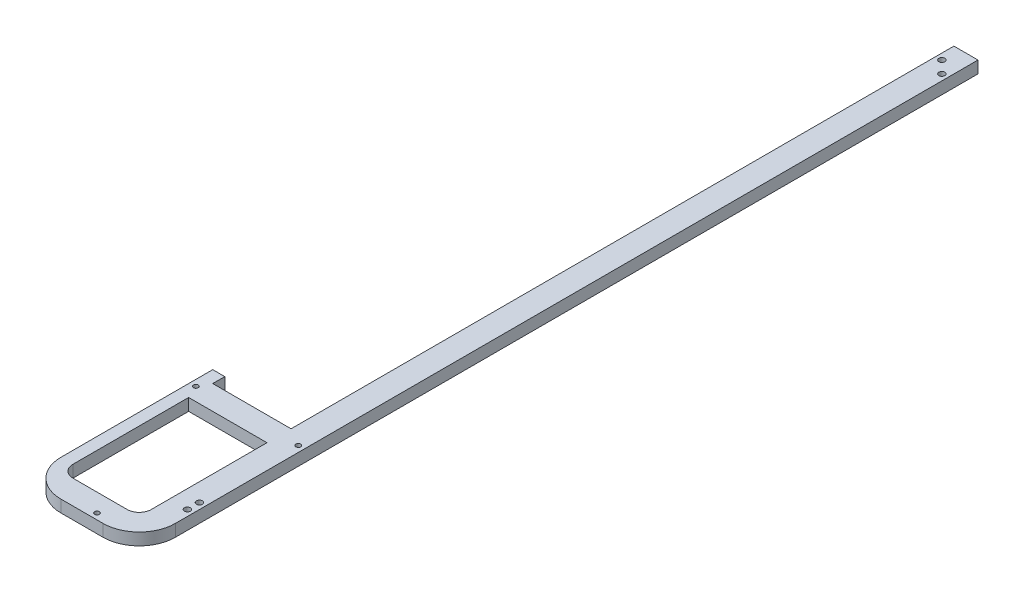
ISO-10303-21;
HEADER;
FILE_DESCRIPTION(('STEP AP214'),'2;1');
FILE_NAME('part.step','',(''),(''),'','','');
FILE_SCHEMA(('AUTOMOTIVE_DESIGN { 1 0 10303 214 1 1 1 1 }'));
ENDSEC;
DATA;
#1=APPLICATION_CONTEXT('core data for automotive mechanical design processes');
#2=APPLICATION_PROTOCOL_DEFINITION('international standard','automotive_design',2000,#1);
#3=PRODUCT_CONTEXT('',#1,'mechanical');
#4=PRODUCT('Part','Part','',(#3));
#5=PRODUCT_RELATED_PRODUCT_CATEGORY('part','',(#4));
#6=PRODUCT_DEFINITION_FORMATION('','',#4);
#7=PRODUCT_DEFINITION_CONTEXT('part definition',#1,'design');
#8=PRODUCT_DEFINITION('design','',#6,#7);
#9=PRODUCT_DEFINITION_SHAPE('','',#8);
#10=(LENGTH_UNIT() NAMED_UNIT(*) SI_UNIT(.MILLI.,.METRE.));
#11=(NAMED_UNIT(*) PLANE_ANGLE_UNIT() SI_UNIT($,.RADIAN.));
#12=(NAMED_UNIT(*) SI_UNIT($,.STERADIAN.) SOLID_ANGLE_UNIT());
#13=UNCERTAINTY_MEASURE_WITH_UNIT(LENGTH_MEASURE(1.E-05),#10,'distance_accuracy_value','');
#14=(GEOMETRIC_REPRESENTATION_CONTEXT(3) GLOBAL_UNCERTAINTY_ASSIGNED_CONTEXT((#13)) GLOBAL_UNIT_ASSIGNED_CONTEXT((#10,
#11,#12)) REPRESENTATION_CONTEXT('',''));
#15=CARTESIAN_POINT('',(0.,0.,0.));
#16=DIRECTION('',(0.,0.,1.));
#17=DIRECTION('',(1.,0.,0.));
#18=AXIS2_PLACEMENT_3D('',#15,#16,#17);
#19=CARTESIAN_POINT('',(47.5,10.,0.));
#20=DIRECTION('',(1.,0.,0.));
#21=DIRECTION('',(0.,0.,-1.));
#22=AXIS2_PLACEMENT_3D('',#19,#20,#21);
#23=PLANE('',#22);
#24=DIRECTION('',(0.,0.,1.));
#25=VECTOR('',#24,1.);
#26=CARTESIAN_POINT('',(47.5,10.,0.));
#27=LINE('',#26,#25);
#28=CARTESIAN_POINT('',(47.5,10.,-626.));
#29=VERTEX_POINT('',#28);
#30=CARTESIAN_POINT('',(47.5,10.,40.));
#31=VERTEX_POINT('',#30);
#32=EDGE_CURVE('E260',#29,#31,#27,.T.);
#33=ORIENTED_EDGE('',*,*,#32,.T.);
#34=DIRECTION('',(0.,-1.,0.));
#35=VECTOR('',#34,1.);
#36=CARTESIAN_POINT('',(47.5,0.,40.));
#37=LINE('',#36,#35);
#38=CARTESIAN_POINT('',(47.5,0.,40.));
#39=VERTEX_POINT('',#38);
#40=EDGE_CURVE('E339',#31,#39,#37,.T.);
#41=ORIENTED_EDGE('',*,*,#40,.T.);
#42=DIRECTION('',(0.,0.,1.));
#43=VECTOR('',#42,1.);
#44=CARTESIAN_POINT('',(47.5,0.,0.));
#45=LINE('',#44,#43);
#46=CARTESIAN_POINT('',(47.5,0.,-626.));
#47=VERTEX_POINT('',#46);
#48=EDGE_CURVE('E240',#47,#39,#45,.T.);
#49=ORIENTED_EDGE('',*,*,#48,.F.);
#50=DIRECTION('',(0.,-1.,0.));
#51=VECTOR('',#50,1.);
#52=CARTESIAN_POINT('',(47.5,10.,-626.));
#53=LINE('',#52,#51);
#54=EDGE_CURVE('E336',#29,#47,#53,.T.);
#55=ORIENTED_EDGE('',*,*,#54,.F.);
#56=EDGE_LOOP('',(#33,#41,#49,#55));
#57=FACE_BOUND('',#56,.T.);
#58=ADVANCED_FACE('F41',(#57),#23,.T.);
#59=CARTESIAN_POINT('',(0.,10.,-626.));
#60=DIRECTION('',(0.,0.,-1.));
#61=DIRECTION('',(-1.,0.,0.));
#62=AXIS2_PLACEMENT_3D('',#59,#60,#61);
#63=PLANE('',#62);
#64=DIRECTION('',(1.,0.,0.));
#65=VECTOR('',#64,1.);
#66=CARTESIAN_POINT('',(0.,0.,-626.));
#67=LINE('',#66,#65);
#68=CARTESIAN_POINT('',(27.5,0.,-626.));
#69=VERTEX_POINT('',#68);
#70=EDGE_CURVE('E295',#69,#47,#67,.T.);
#71=ORIENTED_EDGE('',*,*,#70,.F.);
#72=DIRECTION('',(0.,-1.,0.));
#73=VECTOR('',#72,1.);
#74=CARTESIAN_POINT('',(27.5,10.,-626.));
#75=LINE('',#74,#73);
#76=CARTESIAN_POINT('',(27.5,10.,-626.));
#77=VERTEX_POINT('',#76);
#78=EDGE_CURVE('E333',#77,#69,#75,.T.);
#79=ORIENTED_EDGE('',*,*,#78,.F.);
#80=DIRECTION('',(1.,0.,0.));
#81=VECTOR('',#80,1.);
#82=CARTESIAN_POINT('',(0.,10.,-626.));
#83=LINE('',#82,#81);
#84=EDGE_CURVE('E264',#77,#29,#83,.T.);
#85=ORIENTED_EDGE('',*,*,#84,.T.);
#86=ORIENTED_EDGE('',*,*,#54,.T.);
#87=EDGE_LOOP('',(#71,#79,#85,#86));
#88=FACE_BOUND('',#87,.T.);
#89=ADVANCED_FACE('F400',(#88),#63,.T.);
#90=CARTESIAN_POINT('',(27.5,10.,0.));
#91=DIRECTION('',(-1.,0.,0.));
#92=DIRECTION('',(0.,0.,1.));
#93=AXIS2_PLACEMENT_3D('',#90,#91,#92);
#94=PLANE('',#93);
#95=DIRECTION('',(0.,0.,-1.));
#96=VECTOR('',#95,1.);
#97=CARTESIAN_POINT('',(27.5,0.,0.));
#98=LINE('',#97,#96);
#99=CARTESIAN_POINT('',(27.5,0.,-76.));
#100=VERTEX_POINT('',#99);
#101=EDGE_CURVE('E299',#100,#69,#98,.T.);
#102=ORIENTED_EDGE('',*,*,#101,.F.);
#103=DIRECTION('',(0.,-1.,0.));
#104=VECTOR('',#103,1.);
#105=CARTESIAN_POINT('',(27.5,10.,-76.));
#106=LINE('',#105,#104);
#107=CARTESIAN_POINT('',(27.5,10.,-76.));
#108=VERTEX_POINT('',#107);
#109=EDGE_CURVE('E330',#108,#100,#106,.T.);
#110=ORIENTED_EDGE('',*,*,#109,.F.);
#111=DIRECTION('',(0.,0.,-1.));
#112=VECTOR('',#111,1.);
#113=CARTESIAN_POINT('',(27.5,10.,0.));
#114=LINE('',#113,#112);
#115=EDGE_CURVE('E269',#108,#77,#114,.T.);
#116=ORIENTED_EDGE('',*,*,#115,.T.);
#117=ORIENTED_EDGE('',*,*,#78,.T.);
#118=EDGE_LOOP('',(#102,#110,#116,#117));
#119=FACE_BOUND('',#118,.T.);
#120=ADVANCED_FACE('F406',(#119),#94,.T.);
#121=CARTESIAN_POINT('',(0.,10.,-76.));
#122=DIRECTION('',(0.,0.,-1.));
#123=DIRECTION('',(-1.,0.,0.));
#124=AXIS2_PLACEMENT_3D('',#121,#122,#123);
#125=PLANE('',#124);
#126=DIRECTION('',(1.,0.,0.));
#127=VECTOR('',#126,1.);
#128=CARTESIAN_POINT('',(0.,0.,-76.));
#129=LINE('',#128,#127);
#130=CARTESIAN_POINT('',(-37.5,0.,-76.));
#131=VERTEX_POINT('',#130);
#132=EDGE_CURVE('E303',#131,#100,#129,.T.);
#133=ORIENTED_EDGE('',*,*,#132,.F.);
#134=DIRECTION('',(0.,-1.,0.));
#135=VECTOR('',#134,1.);
#136=CARTESIAN_POINT('',(-37.5,10.,-76.));
#137=LINE('',#136,#135);
#138=CARTESIAN_POINT('',(-37.5,10.,-76.));
#139=VERTEX_POINT('',#138);
#140=EDGE_CURVE('E327',#139,#131,#137,.T.);
#141=ORIENTED_EDGE('',*,*,#140,.F.);
#142=DIRECTION('',(1.,0.,0.));
#143=VECTOR('',#142,1.);
#144=CARTESIAN_POINT('',(0.,10.,-76.));
#145=LINE('',#144,#143);
#146=EDGE_CURVE('E273',#139,#108,#145,.T.);
#147=ORIENTED_EDGE('',*,*,#146,.T.);
#148=ORIENTED_EDGE('',*,*,#109,.T.);
#149=EDGE_LOOP('',(#133,#141,#147,#148));
#150=FACE_BOUND('',#149,.T.);
#151=ADVANCED_FACE('F447',(#150),#125,.T.);
#152=CARTESIAN_POINT('',(-37.5,10.,0.));
#153=DIRECTION('',(-1.,0.,0.));
#154=DIRECTION('',(0.,0.,1.));
#155=AXIS2_PLACEMENT_3D('',#152,#153,#154);
#156=PLANE('',#155);
#157=DIRECTION('',(0.,0.,-1.));
#158=VECTOR('',#157,1.);
#159=CARTESIAN_POINT('',(-37.5,0.,0.));
#160=LINE('',#159,#158);
#161=CARTESIAN_POINT('',(-37.5,0.,-86.));
#162=VERTEX_POINT('',#161);
#163=EDGE_CURVE('E307',#131,#162,#160,.T.);
#164=ORIENTED_EDGE('',*,*,#163,.T.);
#165=DIRECTION('',(0.,-1.,0.));
#166=VECTOR('',#165,1.);
#167=CARTESIAN_POINT('',(-37.5,10.,-86.));
#168=LINE('',#167,#166);
#169=CARTESIAN_POINT('',(-37.5,10.,-86.));
#170=VERTEX_POINT('',#169);
#171=EDGE_CURVE('E324',#170,#162,#168,.T.);
#172=ORIENTED_EDGE('',*,*,#171,.F.);
#173=DIRECTION('',(0.,0.,-1.));
#174=VECTOR('',#173,1.);
#175=CARTESIAN_POINT('',(-37.5,10.,0.));
#176=LINE('',#175,#174);
#177=EDGE_CURVE('E277',#139,#170,#176,.T.);
#178=ORIENTED_EDGE('',*,*,#177,.F.);
#179=ORIENTED_EDGE('',*,*,#140,.T.);
#180=EDGE_LOOP('',(#164,#172,#178,#179));
#181=FACE_BOUND('',#180,.T.);
#182=ADVANCED_FACE('F451',(#181),#156,.F.);
#183=CARTESIAN_POINT('',(0.,10.,-86.));
#184=DIRECTION('',(0.,0.,-1.));
#185=DIRECTION('',(-1.,0.,0.));
#186=AXIS2_PLACEMENT_3D('',#183,#184,#185);
#187=PLANE('',#186);
#188=DIRECTION('',(1.,0.,0.));
#189=VECTOR('',#188,1.);
#190=CARTESIAN_POINT('',(0.,0.,-86.));
#191=LINE('',#190,#189);
#192=CARTESIAN_POINT('',(-47.5,0.,-86.));
#193=VERTEX_POINT('',#192);
#194=EDGE_CURVE('E311',#193,#162,#191,.T.);
#195=ORIENTED_EDGE('',*,*,#194,.F.);
#196=DIRECTION('',(0.,-1.,0.));
#197=VECTOR('',#196,1.);
#198=CARTESIAN_POINT('',(-47.5,10.,-86.));
#199=LINE('',#198,#197);
#200=CARTESIAN_POINT('',(-47.5,10.,-86.));
#201=VERTEX_POINT('',#200);
#202=EDGE_CURVE('E291',#201,#193,#199,.T.);
#203=ORIENTED_EDGE('',*,*,#202,.F.);
#204=DIRECTION('',(1.,0.,0.));
#205=VECTOR('',#204,1.);
#206=CARTESIAN_POINT('',(0.,10.,-86.));
#207=LINE('',#206,#205);
#208=EDGE_CURVE('E280',#201,#170,#207,.T.);
#209=ORIENTED_EDGE('',*,*,#208,.T.);
#210=ORIENTED_EDGE('',*,*,#171,.T.);
#211=EDGE_LOOP('',(#195,#203,#209,#210));
#212=FACE_BOUND('',#211,.T.);
#213=ADVANCED_FACE('F456',(#212),#187,.T.);
#214=CARTESIAN_POINT('',(-47.5,10.,0.));
#215=DIRECTION('',(-1.,0.,0.));
#216=DIRECTION('',(0.,0.,1.));
#217=AXIS2_PLACEMENT_3D('',#214,#215,#216);
#218=PLANE('',#217);
#219=DIRECTION('',(0.,0.,-1.));
#220=VECTOR('',#219,1.);
#221=CARTESIAN_POINT('',(-47.5,0.,0.));
#222=LINE('',#221,#220);
#223=CARTESIAN_POINT('',(-47.5,0.,40.));
#224=VERTEX_POINT('',#223);
#225=EDGE_CURVE('E315',#224,#193,#222,.T.);
#226=ORIENTED_EDGE('',*,*,#225,.F.);
#227=DIRECTION('',(0.,-1.,0.));
#228=VECTOR('',#227,1.);
#229=CARTESIAN_POINT('',(-47.5,10.,40.));
#230=LINE('',#229,#228);
#231=CARTESIAN_POINT('',(-47.5,10.,40.));
#232=VERTEX_POINT('',#231);
#233=EDGE_CURVE('E362',#224,#232,#230,.F.);
#234=ORIENTED_EDGE('',*,*,#233,.T.);
#235=DIRECTION('',(0.,0.,-1.));
#236=VECTOR('',#235,1.);
#237=CARTESIAN_POINT('',(-47.5,10.,0.));
#238=LINE('',#237,#236);
#239=EDGE_CURVE('E284',#232,#201,#238,.T.);
#240=ORIENTED_EDGE('',*,*,#239,.T.);
#241=ORIENTED_EDGE('',*,*,#202,.T.);
#242=EDGE_LOOP('',(#226,#234,#240,#241));
#243=FACE_BOUND('',#242,.T.);
#244=ADVANCED_FACE('F459',(#243),#218,.T.);
#245=CARTESIAN_POINT('',(0.,10.,70.));
#246=DIRECTION('',(0.,0.,-1.));
#247=DIRECTION('',(-1.,0.,0.));
#248=AXIS2_PLACEMENT_3D('',#245,#246,#247);
#249=PLANE('',#248);
#250=DIRECTION('',(1.,0.,0.));
#251=VECTOR('',#250,1.);
#252=CARTESIAN_POINT('',(0.,0.,70.));
#253=LINE('',#252,#251);
#254=CARTESIAN_POINT('',(-17.5,0.,70.));
#255=VERTEX_POINT('',#254);
#256=CARTESIAN_POINT('',(17.5,0.,70.));
#257=VERTEX_POINT('',#256);
#258=EDGE_CURVE('E265',#255,#257,#253,.T.);
#259=ORIENTED_EDGE('',*,*,#258,.T.);
#260=DIRECTION('',(0.,-1.,0.));
#261=VECTOR('',#260,1.);
#262=CARTESIAN_POINT('',(17.5,10.,70.));
#263=LINE('',#262,#261);
#264=CARTESIAN_POINT('',(17.5,10.,70.));
#265=VERTEX_POINT('',#264);
#266=EDGE_CURVE('E353',#257,#265,#263,.F.);
#267=ORIENTED_EDGE('',*,*,#266,.T.);
#268=DIRECTION('',(1.,0.,0.));
#269=VECTOR('',#268,1.);
#270=CARTESIAN_POINT('',(0.,10.,70.));
#271=LINE('',#270,#269);
#272=CARTESIAN_POINT('',(-17.5,10.,70.));
#273=VERTEX_POINT('',#272);
#274=EDGE_CURVE('E287',#273,#265,#271,.T.);
#275=ORIENTED_EDGE('',*,*,#274,.F.);
#276=DIRECTION('',(0.,-1.,0.));
#277=VECTOR('',#276,1.);
#278=CARTESIAN_POINT('',(-17.5,0.,70.));
#279=LINE('',#278,#277);
#280=EDGE_CURVE('E349',#273,#255,#279,.T.);
#281=ORIENTED_EDGE('',*,*,#280,.T.);
#282=EDGE_LOOP('',(#259,#267,#275,#281));
#283=FACE_BOUND('',#282,.T.);
#284=ADVANCED_FACE('F433',(#283),#249,.F.);
#285=CARTESIAN_POINT('',(0.,10.,0.));
#286=DIRECTION('',(0.,1.,0.));
#287=DIRECTION('',(0.,0.,1.));
#288=AXIS2_PLACEMENT_3D('',#285,#286,#287);
#289=PLANE('',#288);
#290=DIRECTION('',(0.,0.,1.));
#291=VECTOR('',#290,1.);
#292=CARTESIAN_POINT('',(-37.5,10.,-56.));
#293=LINE('',#292,#291);
#294=CARTESIAN_POINT('',(-37.5,10.,-56.));
#295=VERTEX_POINT('',#294);
#296=CARTESIAN_POINT('',(-37.5,10.,40.));
#297=VERTEX_POINT('',#296);
#298=EDGE_CURVE('E189',#295,#297,#293,.T.);
#299=ORIENTED_EDGE('',*,*,#298,.F.);
#300=DIRECTION('',(1.,0.,0.));
#301=VECTOR('',#300,1.);
#302=CARTESIAN_POINT('',(-37.5,10.,-56.));
#303=LINE('',#302,#301);
#304=CARTESIAN_POINT('',(27.5,10.,-56.));
#305=VERTEX_POINT('',#304);
#306=EDGE_CURVE('E198',#295,#305,#303,.T.);
#307=ORIENTED_EDGE('',*,*,#306,.T.);
#308=DIRECTION('',(0.,0.,1.));
#309=VECTOR('',#308,1.);
#310=CARTESIAN_POINT('',(27.5,10.,-56.));
#311=LINE('',#310,#309);
#312=CARTESIAN_POINT('',(27.5,10.,40.));
#313=VERTEX_POINT('',#312);
#314=EDGE_CURVE('E172',#305,#313,#311,.T.);
#315=ORIENTED_EDGE('',*,*,#314,.T.);
#316=CARTESIAN_POINT('',(17.5,10.,40.));
#317=DIRECTION('',(0.,1.,0.));
#318=DIRECTION('',(0.,0.,1.));
#319=AXIS2_PLACEMENT_3D('',#316,#317,#318);
#320=CIRCLE('',#319,10.);
#321=CARTESIAN_POINT('',(17.5,10.,50.));
#322=VERTEX_POINT('',#321);
#323=EDGE_CURVE('E377',#313,#322,#320,.F.);
#324=ORIENTED_EDGE('',*,*,#323,.T.);
#325=DIRECTION('',(1.,0.,0.));
#326=VECTOR('',#325,1.);
#327=CARTESIAN_POINT('',(-37.5,10.,50.));
#328=LINE('',#327,#326);
#329=CARTESIAN_POINT('',(-27.5,10.,50.));
#330=VERTEX_POINT('',#329);
#331=EDGE_CURVE('E192',#330,#322,#328,.T.);
#332=ORIENTED_EDGE('',*,*,#331,.F.);
#333=CARTESIAN_POINT('',(-27.5,10.,40.));
#334=DIRECTION('',(0.,1.,0.));
#335=DIRECTION('',(0.,0.,1.));
#336=AXIS2_PLACEMENT_3D('',#333,#334,#335);
#337=CIRCLE('',#336,10.);
#338=EDGE_CURVE('E50',#330,#297,#337,.F.);
#339=ORIENTED_EDGE('',*,*,#338,.T.);
#340=EDGE_LOOP('',(#299,#307,#315,#324,#332,#339));
#341=FACE_BOUND('',#340,.T.);
#342=CARTESIAN_POINT('',(42.5,10.,25.));
#343=DIRECTION('',(0.,1.,0.));
#344=DIRECTION('',(0.,0.,1.));
#345=AXIS2_PLACEMENT_3D('',#342,#343,#344);
#346=CIRCLE('',#345,2.5);
#347=CARTESIAN_POINT('',(42.5,10.,27.5));
#348=VERTEX_POINT('',#347);
#349=EDGE_CURVE('E209',#348,#348,#346,.T.);
#350=ORIENTED_EDGE('',*,*,#349,.F.);
#351=EDGE_LOOP('',(#350));
#352=FACE_BOUND('',#351,.T.);
#353=CARTESIAN_POINT('',(42.5,10.,15.));
#354=DIRECTION('',(0.,1.,0.));
#355=DIRECTION('',(0.,0.,1.));
#356=AXIS2_PLACEMENT_3D('',#353,#354,#355);
#357=CIRCLE('',#356,2.5);
#358=CARTESIAN_POINT('',(42.5,10.,17.5));
#359=VERTEX_POINT('',#358);
#360=EDGE_CURVE('E202',#359,#359,#357,.T.);
#361=ORIENTED_EDGE('',*,*,#360,.F.);
#362=EDGE_LOOP('',(#361));
#363=FACE_BOUND('',#362,.T.);
#364=CARTESIAN_POINT('',(42.5,10.,-601.));
#365=DIRECTION('',(0.,1.,0.));
#366=DIRECTION('',(0.,0.,1.));
#367=AXIS2_PLACEMENT_3D('',#364,#365,#366);
#368=CIRCLE('',#367,2.5);
#369=CARTESIAN_POINT('',(42.5,10.,-598.5));
#370=VERTEX_POINT('',#369);
#371=EDGE_CURVE('E225',#370,#370,#368,.T.);
#372=ORIENTED_EDGE('',*,*,#371,.F.);
#373=EDGE_LOOP('',(#372));
#374=FACE_BOUND('',#373,.T.);
#375=CARTESIAN_POINT('',(32.5,10.,-611.));
#376=DIRECTION('',(0.,1.,0.));
#377=DIRECTION('',(0.,0.,1.));
#378=AXIS2_PLACEMENT_3D('',#375,#376,#377);
#379=CIRCLE('',#378,2.5);
#380=CARTESIAN_POINT('',(32.5,10.,-608.5));
#381=VERTEX_POINT('',#380);
#382=EDGE_CURVE('E208',#381,#381,#379,.T.);
#383=ORIENTED_EDGE('',*,*,#382,.F.);
#384=EDGE_LOOP('',(#383));
#385=FACE_BOUND('',#384,.T.);
#386=CARTESIAN_POINT('',(-42.5,10.,-67.));
#387=DIRECTION('',(0.,1.,0.));
#388=DIRECTION('',(0.,0.,1.));
#389=AXIS2_PLACEMENT_3D('',#386,#387,#388);
#390=CIRCLE('',#389,2.);
#391=CARTESIAN_POINT('',(-42.5,10.,-65.));
#392=VERTEX_POINT('',#391);
#393=EDGE_CURVE('E241',#392,#392,#390,.T.);
#394=ORIENTED_EDGE('',*,*,#393,.F.);
#395=EDGE_LOOP('',(#394));
#396=FACE_BOUND('',#395,.T.);
#397=CARTESIAN_POINT('',(42.5,10.,-67.));
#398=DIRECTION('',(0.,1.,0.));
#399=DIRECTION('',(0.,0.,1.));
#400=AXIS2_PLACEMENT_3D('',#397,#398,#399);
#401=CIRCLE('',#400,2.);
#402=CARTESIAN_POINT('',(42.5,10.,-65.));
#403=VERTEX_POINT('',#402);
#404=EDGE_CURVE('E249',#403,#403,#401,.T.);
#405=ORIENTED_EDGE('',*,*,#404,.F.);
#406=EDGE_LOOP('',(#405));
#407=FACE_BOUND('',#406,.T.);
#408=CARTESIAN_POINT('',(7.50000000000001,10.,65.));
#409=DIRECTION('',(0.,1.,0.));
#410=DIRECTION('',(0.,0.,1.));
#411=AXIS2_PLACEMENT_3D('',#408,#409,#410);
#412=CIRCLE('',#411,2.);
#413=CARTESIAN_POINT('',(7.50000000000001,10.,67.));
#414=VERTEX_POINT('',#413);
#415=EDGE_CURVE('E224',#414,#414,#412,.T.);
#416=ORIENTED_EDGE('',*,*,#415,.F.);
#417=EDGE_LOOP('',(#416));
#418=FACE_BOUND('',#417,.T.);
#419=ORIENTED_EDGE('',*,*,#274,.T.);
#420=CARTESIAN_POINT('',(17.5,10.,40.));
#421=DIRECTION('',(0.,1.,0.));
#422=DIRECTION('',(0.,0.,1.));
#423=AXIS2_PLACEMENT_3D('',#420,#421,#422);
#424=CIRCLE('',#423,30.);
#425=EDGE_CURVE('E359',#265,#31,#424,.T.);
#426=ORIENTED_EDGE('',*,*,#425,.T.);
#427=ORIENTED_EDGE('',*,*,#32,.F.);
#428=ORIENTED_EDGE('',*,*,#84,.F.);
#429=ORIENTED_EDGE('',*,*,#115,.F.);
#430=ORIENTED_EDGE('',*,*,#146,.F.);
#431=ORIENTED_EDGE('',*,*,#177,.T.);
#432=ORIENTED_EDGE('',*,*,#208,.F.);
#433=ORIENTED_EDGE('',*,*,#239,.F.);
#434=CARTESIAN_POINT('',(-17.5,10.,40.));
#435=DIRECTION('',(0.,1.,0.));
#436=DIRECTION('',(0.,0.,1.));
#437=AXIS2_PLACEMENT_3D('',#434,#435,#436);
#438=CIRCLE('',#437,30.);
#439=EDGE_CURVE('E356',#232,#273,#438,.T.);
#440=ORIENTED_EDGE('',*,*,#439,.T.);
#441=EDGE_LOOP('',(#419,#426,#427,#428,#429,#430,#431,#432,#433,#440));
#442=FACE_BOUND('',#441,.T.);
#443=ADVANCED_FACE('F382',(#341,#352,#363,#374,#385,#396,#407,#418,#442),#289,.T.);
#444=CARTESIAN_POINT('',(0.,0.,0.));
#445=DIRECTION('',(0.,1.,0.));
#446=DIRECTION('',(0.,0.,1.));
#447=AXIS2_PLACEMENT_3D('',#444,#445,#446);
#448=PLANE('',#447);
#449=DIRECTION('',(1.,0.,0.));
#450=VECTOR('',#449,1.);
#451=CARTESIAN_POINT('',(-37.5,0.,-56.));
#452=LINE('',#451,#450);
#453=CARTESIAN_POINT('',(-37.5,0.,-56.));
#454=VERTEX_POINT('',#453);
#455=CARTESIAN_POINT('',(27.5,0.,-56.));
#456=VERTEX_POINT('',#455);
#457=EDGE_CURVE('E154',#454,#456,#452,.T.);
#458=ORIENTED_EDGE('',*,*,#457,.F.);
#459=DIRECTION('',(0.,0.,1.));
#460=VECTOR('',#459,1.);
#461=CARTESIAN_POINT('',(-37.5,0.,-56.));
#462=LINE('',#461,#460);
#463=CARTESIAN_POINT('',(-37.5,0.,40.));
#464=VERTEX_POINT('',#463);
#465=EDGE_CURVE('E185',#454,#464,#462,.T.);
#466=ORIENTED_EDGE('',*,*,#465,.T.);
#467=CARTESIAN_POINT('',(-27.5,0.,40.));
#468=DIRECTION('',(0.,1.,0.));
#469=DIRECTION('',(0.,0.,1.));
#470=AXIS2_PLACEMENT_3D('',#467,#468,#469);
#471=CIRCLE('',#470,10.);
#472=CARTESIAN_POINT('',(-27.5,0.,50.));
#473=VERTEX_POINT('',#472);
#474=EDGE_CURVE('E11',#464,#473,#471,.T.);
#475=ORIENTED_EDGE('',*,*,#474,.T.);
#476=DIRECTION('',(1.,0.,0.));
#477=VECTOR('',#476,1.);
#478=CARTESIAN_POINT('',(-37.5,0.,50.));
#479=LINE('',#478,#477);
#480=CARTESIAN_POINT('',(17.5,0.,50.));
#481=VERTEX_POINT('',#480);
#482=EDGE_CURVE('E182',#473,#481,#479,.T.);
#483=ORIENTED_EDGE('',*,*,#482,.T.);
#484=CARTESIAN_POINT('',(17.5,0.,40.));
#485=DIRECTION('',(0.,1.,0.));
#486=DIRECTION('',(0.,0.,1.));
#487=AXIS2_PLACEMENT_3D('',#484,#485,#486);
#488=CIRCLE('',#487,10.);
#489=CARTESIAN_POINT('',(27.5,0.,40.));
#490=VERTEX_POINT('',#489);
#491=EDGE_CURVE('E180',#481,#490,#488,.T.);
#492=ORIENTED_EDGE('',*,*,#491,.T.);
#493=DIRECTION('',(0.,0.,1.));
#494=VECTOR('',#493,1.);
#495=CARTESIAN_POINT('',(27.5,0.,-56.));
#496=LINE('',#495,#494);
#497=EDGE_CURVE('E164',#456,#490,#496,.T.);
#498=ORIENTED_EDGE('',*,*,#497,.F.);
#499=EDGE_LOOP('',(#458,#466,#475,#483,#492,#498));
#500=FACE_BOUND('',#499,.T.);
#501=CARTESIAN_POINT('',(42.5,0.,25.));
#502=DIRECTION('',(0.,1.,0.));
#503=DIRECTION('',(0.,0.,1.));
#504=AXIS2_PLACEMENT_3D('',#501,#502,#503);
#505=CIRCLE('',#504,2.5);
#506=CARTESIAN_POINT('',(42.5,0.,27.5));
#507=VERTEX_POINT('',#506);
#508=EDGE_CURVE('E204',#507,#507,#505,.T.);
#509=ORIENTED_EDGE('',*,*,#508,.T.);
#510=EDGE_LOOP('',(#509));
#511=FACE_BOUND('',#510,.T.);
#512=CARTESIAN_POINT('',(42.5,0.,15.));
#513=DIRECTION('',(0.,1.,0.));
#514=DIRECTION('',(0.,0.,1.));
#515=AXIS2_PLACEMENT_3D('',#512,#513,#514);
#516=CIRCLE('',#515,2.5);
#517=CARTESIAN_POINT('',(42.5,0.,17.5));
#518=VERTEX_POINT('',#517);
#519=EDGE_CURVE('E213',#518,#518,#516,.T.);
#520=ORIENTED_EDGE('',*,*,#519,.T.);
#521=EDGE_LOOP('',(#520));
#522=FACE_BOUND('',#521,.T.);
#523=CARTESIAN_POINT('',(42.5,0.,-601.));
#524=DIRECTION('',(0.,1.,0.));
#525=DIRECTION('',(0.,0.,1.));
#526=AXIS2_PLACEMENT_3D('',#523,#524,#525);
#527=CIRCLE('',#526,2.5);
#528=CARTESIAN_POINT('',(42.5,0.,-598.5));
#529=VERTEX_POINT('',#528);
#530=EDGE_CURVE('E220',#529,#529,#527,.T.);
#531=ORIENTED_EDGE('',*,*,#530,.T.);
#532=EDGE_LOOP('',(#531));
#533=FACE_BOUND('',#532,.T.);
#534=CARTESIAN_POINT('',(32.5,0.,-611.));
#535=DIRECTION('',(0.,1.,0.));
#536=DIRECTION('',(0.,0.,1.));
#537=AXIS2_PLACEMENT_3D('',#534,#535,#536);
#538=CIRCLE('',#537,2.5);
#539=CARTESIAN_POINT('',(32.5,0.,-608.5));
#540=VERTEX_POINT('',#539);
#541=EDGE_CURVE('E229',#540,#540,#538,.T.);
#542=ORIENTED_EDGE('',*,*,#541,.T.);
#543=EDGE_LOOP('',(#542));
#544=FACE_BOUND('',#543,.T.);
#545=CARTESIAN_POINT('',(-42.5,0.,-67.));
#546=DIRECTION('',(0.,1.,0.));
#547=DIRECTION('',(0.,0.,1.));
#548=AXIS2_PLACEMENT_3D('',#545,#546,#547);
#549=CIRCLE('',#548,2.);
#550=CARTESIAN_POINT('',(-42.5,0.,-65.));
#551=VERTEX_POINT('',#550);
#552=EDGE_CURVE('E236',#551,#551,#549,.T.);
#553=ORIENTED_EDGE('',*,*,#552,.T.);
#554=EDGE_LOOP('',(#553));
#555=FACE_BOUND('',#554,.T.);
#556=CARTESIAN_POINT('',(42.5,0.,-67.));
#557=DIRECTION('',(0.,1.,0.));
#558=DIRECTION('',(0.,0.,1.));
#559=AXIS2_PLACEMENT_3D('',#556,#557,#558);
#560=CIRCLE('',#559,2.);
#561=CARTESIAN_POINT('',(42.5,0.,-65.));
#562=VERTEX_POINT('',#561);
#563=EDGE_CURVE('E245',#562,#562,#560,.T.);
#564=ORIENTED_EDGE('',*,*,#563,.T.);
#565=EDGE_LOOP('',(#564));
#566=FACE_BOUND('',#565,.T.);
#567=CARTESIAN_POINT('',(7.50000000000001,0.,65.));
#568=DIRECTION('',(0.,1.,0.));
#569=DIRECTION('',(0.,0.,1.));
#570=AXIS2_PLACEMENT_3D('',#567,#568,#569);
#571=CIRCLE('',#570,2.);
#572=CARTESIAN_POINT('',(7.50000000000001,0.,67.));
#573=VERTEX_POINT('',#572);
#574=EDGE_CURVE('E253',#573,#573,#571,.T.);
#575=ORIENTED_EDGE('',*,*,#574,.T.);
#576=EDGE_LOOP('',(#575));
#577=FACE_BOUND('',#576,.T.);
#578=ORIENTED_EDGE('',*,*,#48,.T.);
#579=CARTESIAN_POINT('',(17.5,0.,40.));
#580=DIRECTION('',(0.,1.,0.));
#581=DIRECTION('',(0.,0.,1.));
#582=AXIS2_PLACEMENT_3D('',#579,#580,#581);
#583=CIRCLE('',#582,30.);
#584=EDGE_CURVE('E346',#39,#257,#583,.F.);
#585=ORIENTED_EDGE('',*,*,#584,.T.);
#586=ORIENTED_EDGE('',*,*,#258,.F.);
#587=CARTESIAN_POINT('',(-17.5,0.,40.));
#588=DIRECTION('',(0.,1.,0.));
#589=DIRECTION('',(0.,0.,1.));
#590=AXIS2_PLACEMENT_3D('',#587,#588,#589);
#591=CIRCLE('',#590,30.);
#592=EDGE_CURVE('E343',#255,#224,#591,.F.);
#593=ORIENTED_EDGE('',*,*,#592,.T.);
#594=ORIENTED_EDGE('',*,*,#225,.T.);
#595=ORIENTED_EDGE('',*,*,#194,.T.);
#596=ORIENTED_EDGE('',*,*,#163,.F.);
#597=ORIENTED_EDGE('',*,*,#132,.T.);
#598=ORIENTED_EDGE('',*,*,#101,.T.);
#599=ORIENTED_EDGE('',*,*,#70,.T.);
#600=EDGE_LOOP('',(#578,#585,#586,#593,#594,#595,#596,#597,#598,#599));
#601=FACE_BOUND('',#600,.T.);
#602=ADVANCED_FACE('F176',(#500,#511,#522,#533,#544,#555,#566,#577,#601),#448,.F.);
#603=CARTESIAN_POINT('',(17.5,10.,40.));
#604=DIRECTION('',(0.,1.,0.));
#605=DIRECTION('',(0.,0.,1.));
#606=AXIS2_PLACEMENT_3D('',#603,#604,#605);
#607=CYLINDRICAL_SURFACE('',#606,30.);
#608=ORIENTED_EDGE('',*,*,#425,.F.);
#609=ORIENTED_EDGE('',*,*,#266,.F.);
#610=ORIENTED_EDGE('',*,*,#584,.F.);
#611=ORIENTED_EDGE('',*,*,#40,.F.);
#612=EDGE_LOOP('',(#608,#609,#610,#611));
#613=FACE_BOUND('',#612,.T.);
#614=ADVANCED_FACE('F411',(#613),#607,.T.);
#615=CARTESIAN_POINT('',(-17.5,10.,40.));
#616=DIRECTION('',(0.,1.,0.));
#617=DIRECTION('',(0.,0.,1.));
#618=AXIS2_PLACEMENT_3D('',#615,#616,#617);
#619=CYLINDRICAL_SURFACE('',#618,30.);
#620=ORIENTED_EDGE('',*,*,#439,.F.);
#621=ORIENTED_EDGE('',*,*,#233,.F.);
#622=ORIENTED_EDGE('',*,*,#592,.F.);
#623=ORIENTED_EDGE('',*,*,#280,.F.);
#624=EDGE_LOOP('',(#620,#621,#622,#623));
#625=FACE_BOUND('',#624,.T.);
#626=ADVANCED_FACE('F413',(#625),#619,.T.);
#627=CARTESIAN_POINT('',(7.50000000000001,0.,65.));
#628=DIRECTION('',(0.,1.,0.));
#629=DIRECTION('',(0.,0.,1.));
#630=AXIS2_PLACEMENT_3D('',#627,#628,#629);
#631=CYLINDRICAL_SURFACE('',#630,2.);
#632=ORIENTED_EDGE('',*,*,#574,.F.);
#633=EDGE_LOOP('',(#632));
#634=FACE_BOUND('',#633,.T.);
#635=ORIENTED_EDGE('',*,*,#415,.T.);
#636=EDGE_LOOP('',(#635));
#637=FACE_BOUND('',#636,.T.);
#638=ADVANCED_FACE('F416',(#634,#637),#631,.F.);
#639=CARTESIAN_POINT('',(42.5,0.,-67.));
#640=DIRECTION('',(0.,1.,0.));
#641=DIRECTION('',(0.,0.,1.));
#642=AXIS2_PLACEMENT_3D('',#639,#640,#641);
#643=CYLINDRICAL_SURFACE('',#642,2.);
#644=ORIENTED_EDGE('',*,*,#563,.F.);
#645=EDGE_LOOP('',(#644));
#646=FACE_BOUND('',#645,.T.);
#647=ORIENTED_EDGE('',*,*,#404,.T.);
#648=EDGE_LOOP('',(#647));
#649=FACE_BOUND('',#648,.T.);
#650=ADVANCED_FACE('F421',(#646,#649),#643,.F.);
#651=CARTESIAN_POINT('',(-42.5,0.,-67.));
#652=DIRECTION('',(0.,1.,0.));
#653=DIRECTION('',(0.,0.,1.));
#654=AXIS2_PLACEMENT_3D('',#651,#652,#653);
#655=CYLINDRICAL_SURFACE('',#654,2.);
#656=ORIENTED_EDGE('',*,*,#552,.F.);
#657=EDGE_LOOP('',(#656));
#658=FACE_BOUND('',#657,.T.);
#659=ORIENTED_EDGE('',*,*,#393,.T.);
#660=EDGE_LOOP('',(#659));
#661=FACE_BOUND('',#660,.T.);
#662=ADVANCED_FACE('F573',(#658,#661),#655,.F.);
#663=CARTESIAN_POINT('',(32.5,0.,-611.));
#664=DIRECTION('',(0.,1.,0.));
#665=DIRECTION('',(0.,0.,1.));
#666=AXIS2_PLACEMENT_3D('',#663,#664,#665);
#667=CYLINDRICAL_SURFACE('',#666,2.5);
#668=ORIENTED_EDGE('',*,*,#541,.F.);
#669=EDGE_LOOP('',(#668));
#670=FACE_BOUND('',#669,.T.);
#671=ORIENTED_EDGE('',*,*,#382,.T.);
#672=EDGE_LOOP('',(#671));
#673=FACE_BOUND('',#672,.T.);
#674=ADVANCED_FACE('F569',(#670,#673),#667,.F.);
#675=CARTESIAN_POINT('',(42.5,0.,-601.));
#676=DIRECTION('',(0.,1.,0.));
#677=DIRECTION('',(0.,0.,1.));
#678=AXIS2_PLACEMENT_3D('',#675,#676,#677);
#679=CYLINDRICAL_SURFACE('',#678,2.5);
#680=ORIENTED_EDGE('',*,*,#530,.F.);
#681=EDGE_LOOP('',(#680));
#682=FACE_BOUND('',#681,.T.);
#683=ORIENTED_EDGE('',*,*,#371,.T.);
#684=EDGE_LOOP('',(#683));
#685=FACE_BOUND('',#684,.T.);
#686=ADVANCED_FACE('F565',(#682,#685),#679,.F.);
#687=CARTESIAN_POINT('',(42.5,0.,15.));
#688=DIRECTION('',(0.,1.,0.));
#689=DIRECTION('',(0.,0.,1.));
#690=AXIS2_PLACEMENT_3D('',#687,#688,#689);
#691=CYLINDRICAL_SURFACE('',#690,2.5);
#692=ORIENTED_EDGE('',*,*,#519,.F.);
#693=EDGE_LOOP('',(#692));
#694=FACE_BOUND('',#693,.T.);
#695=ORIENTED_EDGE('',*,*,#360,.T.);
#696=EDGE_LOOP('',(#695));
#697=FACE_BOUND('',#696,.T.);
#698=ADVANCED_FACE('F561',(#694,#697),#691,.F.);
#699=CARTESIAN_POINT('',(42.5,0.,25.));
#700=DIRECTION('',(0.,1.,0.));
#701=DIRECTION('',(0.,0.,1.));
#702=AXIS2_PLACEMENT_3D('',#699,#700,#701);
#703=CYLINDRICAL_SURFACE('',#702,2.5);
#704=ORIENTED_EDGE('',*,*,#508,.F.);
#705=EDGE_LOOP('',(#704));
#706=FACE_BOUND('',#705,.T.);
#707=ORIENTED_EDGE('',*,*,#349,.T.);
#708=EDGE_LOOP('',(#707));
#709=FACE_BOUND('',#708,.T.);
#710=ADVANCED_FACE('F527',(#706,#709),#703,.F.);
#711=CARTESIAN_POINT('',(-37.5,0.,-56.));
#712=DIRECTION('',(-1.,0.,0.));
#713=DIRECTION('',(0.,0.,1.));
#714=AXIS2_PLACEMENT_3D('',#711,#712,#713);
#715=PLANE('',#714);
#716=ORIENTED_EDGE('',*,*,#298,.T.);
#717=DIRECTION('',(0.,1.,0.));
#718=VECTOR('',#717,1.);
#719=CARTESIAN_POINT('',(-37.5,0.,40.));
#720=LINE('',#719,#718);
#721=EDGE_CURVE('E57',#297,#464,#720,.F.);
#722=ORIENTED_EDGE('',*,*,#721,.T.);
#723=ORIENTED_EDGE('',*,*,#465,.F.);
#724=DIRECTION('',(0.,1.,0.));
#725=VECTOR('',#724,1.);
#726=CARTESIAN_POINT('',(-37.5,0.,-56.));
#727=LINE('',#726,#725);
#728=EDGE_CURVE('E160',#454,#295,#727,.T.);
#729=ORIENTED_EDGE('',*,*,#728,.T.);
#730=EDGE_LOOP('',(#716,#722,#723,#729));
#731=FACE_BOUND('',#730,.T.);
#732=ADVANCED_FACE('F522',(#731),#715,.F.);
#733=CARTESIAN_POINT('',(-37.5,0.,-56.));
#734=DIRECTION('',(0.,0.,1.));
#735=DIRECTION('',(1.,0.,0.));
#736=AXIS2_PLACEMENT_3D('',#733,#734,#735);
#737=PLANE('',#736);
#738=ORIENTED_EDGE('',*,*,#306,.F.);
#739=ORIENTED_EDGE('',*,*,#728,.F.);
#740=ORIENTED_EDGE('',*,*,#457,.T.);
#741=DIRECTION('',(0.,1.,0.));
#742=VECTOR('',#741,1.);
#743=CARTESIAN_POINT('',(27.5,0.,-56.));
#744=LINE('',#743,#742);
#745=EDGE_CURVE('E158',#456,#305,#744,.T.);
#746=ORIENTED_EDGE('',*,*,#745,.T.);
#747=EDGE_LOOP('',(#738,#739,#740,#746));
#748=FACE_BOUND('',#747,.T.);
#749=ADVANCED_FACE('F157',(#748),#737,.T.);
#750=CARTESIAN_POINT('',(27.5,0.,-56.));
#751=DIRECTION('',(-1.,0.,0.));
#752=DIRECTION('',(0.,0.,1.));
#753=AXIS2_PLACEMENT_3D('',#750,#751,#752);
#754=PLANE('',#753);
#755=ORIENTED_EDGE('',*,*,#497,.T.);
#756=DIRECTION('',(0.,1.,0.));
#757=VECTOR('',#756,1.);
#758=CARTESIAN_POINT('',(27.5,0.,40.));
#759=LINE('',#758,#757);
#760=EDGE_CURVE('E365',#490,#313,#759,.T.);
#761=ORIENTED_EDGE('',*,*,#760,.T.);
#762=ORIENTED_EDGE('',*,*,#314,.F.);
#763=ORIENTED_EDGE('',*,*,#745,.F.);
#764=EDGE_LOOP('',(#755,#761,#762,#763));
#765=FACE_BOUND('',#764,.T.);
#766=ADVANCED_FACE('F168',(#765),#754,.T.);
#767=CARTESIAN_POINT('',(-37.5,0.,50.));
#768=DIRECTION('',(0.,0.,1.));
#769=DIRECTION('',(1.,0.,0.));
#770=AXIS2_PLACEMENT_3D('',#767,#768,#769);
#771=PLANE('',#770);
#772=ORIENTED_EDGE('',*,*,#331,.T.);
#773=DIRECTION('',(0.,1.,0.));
#774=VECTOR('',#773,1.);
#775=CARTESIAN_POINT('',(17.5,0.,50.));
#776=LINE('',#775,#774);
#777=EDGE_CURVE('E372',#322,#481,#776,.F.);
#778=ORIENTED_EDGE('',*,*,#777,.T.);
#779=ORIENTED_EDGE('',*,*,#482,.F.);
#780=DIRECTION('',(0.,1.,0.));
#781=VECTOR('',#780,1.);
#782=CARTESIAN_POINT('',(-27.5,10.,50.));
#783=LINE('',#782,#781);
#784=EDGE_CURVE('E368',#473,#330,#783,.T.);
#785=ORIENTED_EDGE('',*,*,#784,.T.);
#786=EDGE_LOOP('',(#772,#778,#779,#785));
#787=FACE_BOUND('',#786,.T.);
#788=ADVANCED_FACE('F387',(#787),#771,.F.);
#789=CARTESIAN_POINT('',(17.5,0.,40.));
#790=DIRECTION('',(0.,1.,0.));
#791=DIRECTION('',(0.,0.,1.));
#792=AXIS2_PLACEMENT_3D('',#789,#790,#791);
#793=CYLINDRICAL_SURFACE('',#792,10.);
#794=ORIENTED_EDGE('',*,*,#491,.F.);
#795=ORIENTED_EDGE('',*,*,#777,.F.);
#796=ORIENTED_EDGE('',*,*,#323,.F.);
#797=ORIENTED_EDGE('',*,*,#760,.F.);
#798=EDGE_LOOP('',(#794,#795,#796,#797));
#799=FACE_BOUND('',#798,.T.);
#800=ADVANCED_FACE('F390',(#799),#793,.F.);
#801=CARTESIAN_POINT('',(-27.5,0.,40.));
#802=DIRECTION('',(0.,-1.,0.));
#803=DIRECTION('',(0.,0.,-1.));
#804=AXIS2_PLACEMENT_3D('',#801,#802,#803);
#805=CYLINDRICAL_SURFACE('',#804,10.);
#806=ORIENTED_EDGE('',*,*,#474,.F.);
#807=ORIENTED_EDGE('',*,*,#721,.F.);
#808=ORIENTED_EDGE('',*,*,#338,.F.);
#809=ORIENTED_EDGE('',*,*,#784,.F.);
#810=EDGE_LOOP('',(#806,#807,#808,#809));
#811=FACE_BOUND('',#810,.T.);
#812=ADVANCED_FACE('F43',(#811),#805,.F.);
#813=CLOSED_SHELL('',(#58,#89,#120,#151,#182,#213,#244,#284,#443,#602,#614,#626,#638,#650,#662,
#674,#686,#698,#710,#732,#749,#766,#788,#800,#812));
#814=MANIFOLD_SOLID_BREP('B2',#813);
#815=ADVANCED_BREP_SHAPE_REPRESENTATION('',(#18,#814),#14);
#816=SHAPE_DEFINITION_REPRESENTATION(#9,#815);
ENDSEC;
END-ISO-10303-21;
